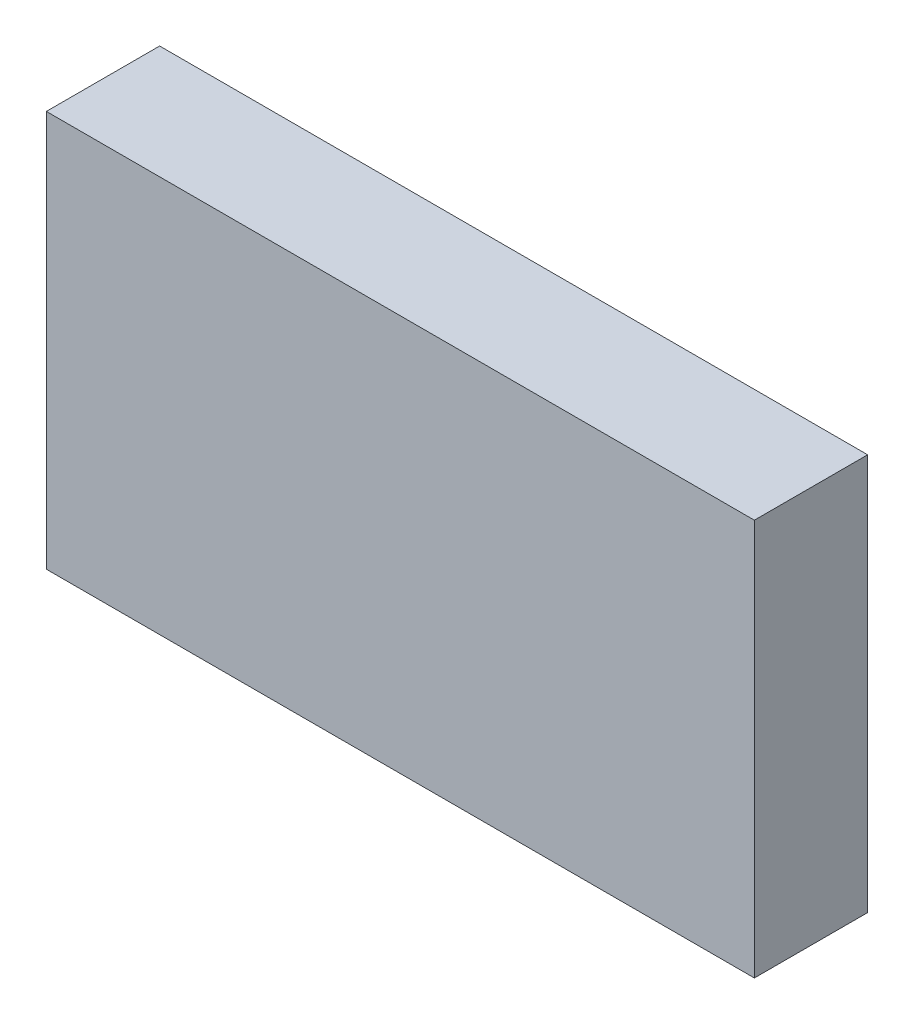
ISO-10303-21;
HEADER;
FILE_DESCRIPTION(('STEP AP214'),'2;1');
FILE_NAME('part.step','',(''),(''),'','','');
FILE_SCHEMA(('AUTOMOTIVE_DESIGN { 1 0 10303 214 1 1 1 1 }'));
ENDSEC;
DATA;
#1=APPLICATION_CONTEXT('core data for automotive mechanical design processes');
#2=APPLICATION_PROTOCOL_DEFINITION('international standard','automotive_design',2000,#1);
#3=PRODUCT_CONTEXT('',#1,'mechanical');
#4=PRODUCT('Part','Part','',(#3));
#5=PRODUCT_RELATED_PRODUCT_CATEGORY('part','',(#4));
#6=PRODUCT_DEFINITION_FORMATION('','',#4);
#7=PRODUCT_DEFINITION_CONTEXT('part definition',#1,'design');
#8=PRODUCT_DEFINITION('design','',#6,#7);
#9=PRODUCT_DEFINITION_SHAPE('','',#8);
#10=(LENGTH_UNIT() NAMED_UNIT(*) SI_UNIT(.MILLI.,.METRE.));
#11=(NAMED_UNIT(*) PLANE_ANGLE_UNIT() SI_UNIT($,.RADIAN.));
#12=(NAMED_UNIT(*) SI_UNIT($,.STERADIAN.) SOLID_ANGLE_UNIT());
#13=UNCERTAINTY_MEASURE_WITH_UNIT(LENGTH_MEASURE(1.E-05),#10,'distance_accuracy_value','');
#14=(GEOMETRIC_REPRESENTATION_CONTEXT(3) GLOBAL_UNCERTAINTY_ASSIGNED_CONTEXT((#13)) GLOBAL_UNIT_ASSIGNED_CONTEXT((#10,
#11,#12)) REPRESENTATION_CONTEXT('',''));
#15=CARTESIAN_POINT('',(0.,0.,0.));
#16=DIRECTION('',(0.,0.,1.));
#17=DIRECTION('',(1.,0.,0.));
#18=AXIS2_PLACEMENT_3D('',#15,#16,#17);
#19=CARTESIAN_POINT('',(79.375,-44.45,-6.35));
#20=DIRECTION('',(1.,0.,0.));
#21=DIRECTION('',(0.,0.,-1.));
#22=AXIS2_PLACEMENT_3D('',#19,#20,#21);
#23=PLANE('',#22);
#24=DIRECTION('',(0.,1.,0.));
#25=VECTOR('',#24,1.);
#26=CARTESIAN_POINT('',(79.375,-44.45,19.05));
#27=LINE('',#26,#25);
#28=CARTESIAN_POINT('',(79.375,-44.45,19.05));
#29=VERTEX_POINT('',#28);
#30=CARTESIAN_POINT('',(79.375,44.45,19.05));
#31=VERTEX_POINT('',#30);
#32=EDGE_CURVE('E113',#29,#31,#27,.T.);
#33=ORIENTED_EDGE('',*,*,#32,.F.);
#34=DIRECTION('',(0.,0.,1.));
#35=VECTOR('',#34,1.);
#36=CARTESIAN_POINT('',(79.375,-44.45,-6.35));
#37=LINE('',#36,#35);
#38=CARTESIAN_POINT('',(79.375,-44.45,-6.35));
#39=VERTEX_POINT('',#38);
#40=EDGE_CURVE('E12',#39,#29,#37,.T.);
#41=ORIENTED_EDGE('',*,*,#40,.F.);
#42=DIRECTION('',(0.,1.,0.));
#43=VECTOR('',#42,1.);
#44=CARTESIAN_POINT('',(79.375,-44.45,-6.35));
#45=LINE('',#44,#43);
#46=CARTESIAN_POINT('',(79.375,44.45,-6.35));
#47=VERTEX_POINT('',#46);
#48=EDGE_CURVE('E107',#39,#47,#45,.T.);
#49=ORIENTED_EDGE('',*,*,#48,.T.);
#50=DIRECTION('',(0.,0.,1.));
#51=VECTOR('',#50,1.);
#52=CARTESIAN_POINT('',(79.375,44.45,-6.35));
#53=LINE('',#52,#51);
#54=EDGE_CURVE('E52',#47,#31,#53,.T.);
#55=ORIENTED_EDGE('',*,*,#54,.T.);
#56=EDGE_LOOP('',(#33,#41,#49,#55));
#57=FACE_BOUND('',#56,.T.);
#58=ADVANCED_FACE('F49',(#57),#23,.T.);
#59=CARTESIAN_POINT('',(-79.375,-44.45,-6.35));
#60=DIRECTION('',(0.,-1.,0.));
#61=DIRECTION('',(0.,0.,-1.));
#62=AXIS2_PLACEMENT_3D('',#59,#60,#61);
#63=PLANE('',#62);
#64=DIRECTION('',(1.,0.,0.));
#65=VECTOR('',#64,1.);
#66=CARTESIAN_POINT('',(-79.375,-44.45,19.05));
#67=LINE('',#66,#65);
#68=CARTESIAN_POINT('',(-79.375,-44.45,19.05));
#69=VERTEX_POINT('',#68);
#70=EDGE_CURVE('E109',#69,#29,#67,.T.);
#71=ORIENTED_EDGE('',*,*,#70,.F.);
#72=DIRECTION('',(0.,0.,1.));
#73=VECTOR('',#72,1.);
#74=CARTESIAN_POINT('',(-79.375,-44.45,-6.35));
#75=LINE('',#74,#73);
#76=CARTESIAN_POINT('',(-79.375,-44.45,-6.35));
#77=VERTEX_POINT('',#76);
#78=EDGE_CURVE('E58',#77,#69,#75,.T.);
#79=ORIENTED_EDGE('',*,*,#78,.F.);
#80=DIRECTION('',(1.,0.,0.));
#81=VECTOR('',#80,1.);
#82=CARTESIAN_POINT('',(-79.375,-44.45,-6.35));
#83=LINE('',#82,#81);
#84=EDGE_CURVE('E104',#77,#39,#83,.T.);
#85=ORIENTED_EDGE('',*,*,#84,.T.);
#86=ORIENTED_EDGE('',*,*,#40,.T.);
#87=EDGE_LOOP('',(#71,#79,#85,#86));
#88=FACE_BOUND('',#87,.T.);
#89=ADVANCED_FACE('F123',(#88),#63,.T.);
#90=CARTESIAN_POINT('',(-79.375,-44.45,-6.35));
#91=DIRECTION('',(-1.,0.,0.));
#92=DIRECTION('',(0.,0.,1.));
#93=AXIS2_PLACEMENT_3D('',#90,#91,#92);
#94=PLANE('',#93);
#95=DIRECTION('',(0.,-1.,0.));
#96=VECTOR('',#95,1.);
#97=CARTESIAN_POINT('',(-79.375,-44.45,19.05));
#98=LINE('',#97,#96);
#99=CARTESIAN_POINT('',(-79.375,44.45,19.05));
#100=VERTEX_POINT('',#99);
#101=EDGE_CURVE('E99',#100,#69,#98,.T.);
#102=ORIENTED_EDGE('',*,*,#101,.F.);
#103=DIRECTION('',(0.,0.,1.));
#104=VECTOR('',#103,1.);
#105=CARTESIAN_POINT('',(-79.375,44.45,-6.35));
#106=LINE('',#105,#104);
#107=CARTESIAN_POINT('',(-79.375,44.45,-6.35));
#108=VERTEX_POINT('',#107);
#109=EDGE_CURVE('E94',#108,#100,#106,.T.);
#110=ORIENTED_EDGE('',*,*,#109,.F.);
#111=DIRECTION('',(0.,-1.,0.));
#112=VECTOR('',#111,1.);
#113=CARTESIAN_POINT('',(-79.375,-44.45,-6.35));
#114=LINE('',#113,#112);
#115=EDGE_CURVE('E97',#108,#77,#114,.T.);
#116=ORIENTED_EDGE('',*,*,#115,.T.);
#117=ORIENTED_EDGE('',*,*,#78,.T.);
#118=EDGE_LOOP('',(#102,#110,#116,#117));
#119=FACE_BOUND('',#118,.T.);
#120=ADVANCED_FACE('F96',(#119),#94,.T.);
#121=CARTESIAN_POINT('',(-79.375,44.45,-6.35));
#122=DIRECTION('',(0.,1.,0.));
#123=DIRECTION('',(0.,0.,1.));
#124=AXIS2_PLACEMENT_3D('',#121,#122,#123);
#125=PLANE('',#124);
#126=DIRECTION('',(-1.,0.,0.));
#127=VECTOR('',#126,1.);
#128=CARTESIAN_POINT('',(-79.375,44.45,19.05));
#129=LINE('',#128,#127);
#130=EDGE_CURVE('E116',#31,#100,#129,.T.);
#131=ORIENTED_EDGE('',*,*,#130,.F.);
#132=ORIENTED_EDGE('',*,*,#54,.F.);
#133=DIRECTION('',(-1.,0.,0.));
#134=VECTOR('',#133,1.);
#135=CARTESIAN_POINT('',(-79.375,44.45,-6.35));
#136=LINE('',#135,#134);
#137=EDGE_CURVE('E103',#47,#108,#136,.T.);
#138=ORIENTED_EDGE('',*,*,#137,.T.);
#139=ORIENTED_EDGE('',*,*,#109,.T.);
#140=EDGE_LOOP('',(#131,#132,#138,#139));
#141=FACE_BOUND('',#140,.T.);
#142=ADVANCED_FACE('F106',(#141),#125,.T.);
#143=CARTESIAN_POINT('',(79.3749999999999,44.45,-6.35));
#144=DIRECTION('',(0.,0.,-1.));
#145=DIRECTION('',(-1.,0.,0.));
#146=AXIS2_PLACEMENT_3D('',#143,#144,#145);
#147=PLANE('',#146);
#148=ORIENTED_EDGE('',*,*,#48,.F.);
#149=ORIENTED_EDGE('',*,*,#84,.F.);
#150=ORIENTED_EDGE('',*,*,#115,.F.);
#151=ORIENTED_EDGE('',*,*,#137,.F.);
#152=EDGE_LOOP('',(#148,#149,#150,#151));
#153=FACE_BOUND('',#152,.T.);
#154=ADVANCED_FACE('F102',(#153),#147,.T.);
#155=CARTESIAN_POINT('',(79.3749999999999,44.45,19.05));
#156=DIRECTION('',(0.,0.,-1.));
#157=DIRECTION('',(-1.,0.,0.));
#158=AXIS2_PLACEMENT_3D('',#155,#156,#157);
#159=PLANE('',#158);
#160=ORIENTED_EDGE('',*,*,#32,.T.);
#161=ORIENTED_EDGE('',*,*,#130,.T.);
#162=ORIENTED_EDGE('',*,*,#101,.T.);
#163=ORIENTED_EDGE('',*,*,#70,.T.);
#164=EDGE_LOOP('',(#160,#161,#162,#163));
#165=FACE_BOUND('',#164,.T.);
#166=ADVANCED_FACE('F122',(#165),#159,.F.);
#167=CLOSED_SHELL('',(#58,#89,#120,#142,#154,#166));
#168=MANIFOLD_SOLID_BREP('B2',#167);
#169=CARTESIAN_POINT('',(76.2,-41.275,19.05));
#170=DIRECTION('',(-1.,0.,0.));
#171=DIRECTION('',(0.,0.,1.));
#172=AXIS2_PLACEMENT_3D('',#169,#170,#171);
#173=PLANE('',#172);
#174=DIRECTION('',(0.,1.,0.));
#175=VECTOR('',#174,1.);
#176=CARTESIAN_POINT('',(76.2,-41.275,0.));
#177=LINE('',#176,#175);
#178=CARTESIAN_POINT('',(76.2,-38.735,0.));
#179=VERTEX_POINT('',#178);
#180=CARTESIAN_POINT('',(76.2,38.735,0.));
#181=VERTEX_POINT('',#180);
#182=EDGE_CURVE('E367',#179,#181,#177,.T.);
#183=ORIENTED_EDGE('',*,*,#182,.T.);
#184=DIRECTION('',(0.,0.,-1.));
#185=VECTOR('',#184,1.);
#186=CARTESIAN_POINT('',(76.2,38.735,19.05));
#187=LINE('',#186,#185);
#188=CARTESIAN_POINT('',(76.2,38.735,19.05));
#189=VERTEX_POINT('',#188);
#190=EDGE_CURVE('E416',#181,#189,#187,.F.);
#191=ORIENTED_EDGE('',*,*,#190,.T.);
#192=DIRECTION('',(0.,1.,0.));
#193=VECTOR('',#192,1.);
#194=CARTESIAN_POINT('',(76.2,-41.275,19.05));
#195=LINE('',#194,#193);
#196=CARTESIAN_POINT('',(76.2,-38.735,19.05));
#197=VERTEX_POINT('',#196);
#198=EDGE_CURVE('E377',#197,#189,#195,.T.);
#199=ORIENTED_EDGE('',*,*,#198,.F.);
#200=DIRECTION('',(0.,0.,-1.));
#201=VECTOR('',#200,1.);
#202=CARTESIAN_POINT('',(76.2,-38.735,19.05));
#203=LINE('',#202,#201);
#204=EDGE_CURVE('E413',#197,#179,#203,.T.);
#205=ORIENTED_EDGE('',*,*,#204,.T.);
#206=EDGE_LOOP('',(#183,#191,#199,#205));
#207=FACE_BOUND('',#206,.T.);
#208=ADVANCED_FACE('F173',(#207),#173,.F.);
#209=CARTESIAN_POINT('',(-76.2,41.275,19.05));
#210=DIRECTION('',(0.,-1.,0.));
#211=DIRECTION('',(0.,0.,-1.));
#212=AXIS2_PLACEMENT_3D('',#209,#210,#211);
#213=PLANE('',#212);
#214=DIRECTION('',(-1.,0.,0.));
#215=VECTOR('',#214,1.);
#216=CARTESIAN_POINT('',(-76.2,41.275,19.05));
#217=LINE('',#216,#215);
#218=CARTESIAN_POINT('',(73.66,41.275,19.05));
#219=VERTEX_POINT('',#218);
#220=CARTESIAN_POINT('',(-73.66,41.275,19.05));
#221=VERTEX_POINT('',#220);
#222=EDGE_CURVE('E380',#219,#221,#217,.T.);
#223=ORIENTED_EDGE('',*,*,#222,.F.);
#224=DIRECTION('',(0.,0.,-1.));
#225=VECTOR('',#224,1.);
#226=CARTESIAN_POINT('',(73.66,41.275,19.05));
#227=LINE('',#226,#225);
#228=CARTESIAN_POINT('',(73.66,41.275,0.));
#229=VERTEX_POINT('',#228);
#230=EDGE_CURVE('E402',#219,#229,#227,.T.);
#231=ORIENTED_EDGE('',*,*,#230,.T.);
#232=DIRECTION('',(-1.,0.,0.));
#233=VECTOR('',#232,1.);
#234=CARTESIAN_POINT('',(-76.2,41.275,0.));
#235=LINE('',#234,#233);
#236=CARTESIAN_POINT('',(-73.66,41.275,0.));
#237=VERTEX_POINT('',#236);
#238=EDGE_CURVE('E393',#229,#237,#235,.T.);
#239=ORIENTED_EDGE('',*,*,#238,.T.);
#240=DIRECTION('',(0.,0.,-1.));
#241=VECTOR('',#240,1.);
#242=CARTESIAN_POINT('',(-73.66,41.275,19.05));
#243=LINE('',#242,#241);
#244=EDGE_CURVE('E390',#237,#221,#243,.F.);
#245=ORIENTED_EDGE('',*,*,#244,.T.);
#246=EDGE_LOOP('',(#223,#231,#239,#245));
#247=FACE_BOUND('',#246,.T.);
#248=ADVANCED_FACE('F548',(#247),#213,.F.);
#249=CARTESIAN_POINT('',(-76.2,-41.275,19.05));
#250=DIRECTION('',(1.,0.,0.));
#251=DIRECTION('',(0.,0.,-1.));
#252=AXIS2_PLACEMENT_3D('',#249,#250,#251);
#253=PLANE('',#252);
#254=DIRECTION('',(0.,-1.,0.));
#255=VECTOR('',#254,1.);
#256=CARTESIAN_POINT('',(-76.2,-41.275,0.));
#257=LINE('',#256,#255);
#258=CARTESIAN_POINT('',(-76.2,38.735,0.));
#259=VERTEX_POINT('',#258);
#260=CARTESIAN_POINT('',(-76.2,-38.735,0.));
#261=VERTEX_POINT('',#260);
#262=EDGE_CURVE('E396',#259,#261,#257,.T.);
#263=ORIENTED_EDGE('',*,*,#262,.T.);
#264=DIRECTION('',(0.,0.,-1.));
#265=VECTOR('',#264,1.);
#266=CARTESIAN_POINT('',(-76.2,-38.735,19.05));
#267=LINE('',#266,#265);
#268=CARTESIAN_POINT('',(-76.2,-38.735,19.05));
#269=VERTEX_POINT('',#268);
#270=EDGE_CURVE('E434',#261,#269,#267,.F.);
#271=ORIENTED_EDGE('',*,*,#270,.T.);
#272=DIRECTION('',(0.,-1.,0.));
#273=VECTOR('',#272,1.);
#274=CARTESIAN_POINT('',(-76.2,-41.275,19.05));
#275=LINE('',#274,#273);
#276=CARTESIAN_POINT('',(-76.2,38.735,19.05));
#277=VERTEX_POINT('',#276);
#278=EDGE_CURVE('E384',#277,#269,#275,.T.);
#279=ORIENTED_EDGE('',*,*,#278,.F.);
#280=DIRECTION('',(0.,0.,-1.));
#281=VECTOR('',#280,1.);
#282=CARTESIAN_POINT('',(-76.2,38.735,19.05));
#283=LINE('',#282,#281);
#284=EDGE_CURVE('E431',#277,#259,#283,.T.);
#285=ORIENTED_EDGE('',*,*,#284,.T.);
#286=EDGE_LOOP('',(#263,#271,#279,#285));
#287=FACE_BOUND('',#286,.T.);
#288=ADVANCED_FACE('F554',(#287),#253,.F.);
#289=CARTESIAN_POINT('',(-76.2,-41.275,19.05));
#290=DIRECTION('',(0.,1.,0.));
#291=DIRECTION('',(0.,0.,1.));
#292=AXIS2_PLACEMENT_3D('',#289,#290,#291);
#293=PLANE('',#292);
#294=DIRECTION('',(1.,0.,0.));
#295=VECTOR('',#294,1.);
#296=CARTESIAN_POINT('',(-76.2,-41.275,0.));
#297=LINE('',#296,#295);
#298=CARTESIAN_POINT('',(-73.66,-41.275,0.));
#299=VERTEX_POINT('',#298);
#300=CARTESIAN_POINT('',(73.66,-41.275,0.));
#301=VERTEX_POINT('',#300);
#302=EDGE_CURVE('E381',#299,#301,#297,.T.);
#303=ORIENTED_EDGE('',*,*,#302,.T.);
#304=DIRECTION('',(0.,0.,-1.));
#305=VECTOR('',#304,1.);
#306=CARTESIAN_POINT('',(73.66,-41.275,19.05));
#307=LINE('',#306,#305);
#308=CARTESIAN_POINT('',(73.66,-41.275,19.05));
#309=VERTEX_POINT('',#308);
#310=EDGE_CURVE('E429',#301,#309,#307,.F.);
#311=ORIENTED_EDGE('',*,*,#310,.T.);
#312=DIRECTION('',(1.,0.,0.));
#313=VECTOR('',#312,1.);
#314=CARTESIAN_POINT('',(-76.2,-41.275,19.05));
#315=LINE('',#314,#313);
#316=CARTESIAN_POINT('',(-73.66,-41.275,19.05));
#317=VERTEX_POINT('',#316);
#318=EDGE_CURVE('E387',#317,#309,#315,.T.);
#319=ORIENTED_EDGE('',*,*,#318,.F.);
#320=DIRECTION('',(0.,0.,-1.));
#321=VECTOR('',#320,1.);
#322=CARTESIAN_POINT('',(-73.66,-41.275,19.05));
#323=LINE('',#322,#321);
#324=EDGE_CURVE('E426',#317,#299,#323,.T.);
#325=ORIENTED_EDGE('',*,*,#324,.T.);
#326=EDGE_LOOP('',(#303,#311,#319,#325));
#327=FACE_BOUND('',#326,.T.);
#328=ADVANCED_FACE('F606',(#327),#293,.F.);
#329=CARTESIAN_POINT('',(76.2,41.275,19.05));
#330=DIRECTION('',(0.,0.,-1.));
#331=DIRECTION('',(-1.,0.,0.));
#332=AXIS2_PLACEMENT_3D('',#329,#330,#331);
#333=PLANE('',#332);
#334=DIRECTION('',(0.,-1.,0.));
#335=VECTOR('',#334,1.);
#336=CARTESIAN_POINT('',(-60.325,36.195,19.05));
#337=LINE('',#336,#335);
#338=CARTESIAN_POINT('',(-60.325,-22.225,19.05));
#339=VERTEX_POINT('',#338);
#340=CARTESIAN_POINT('',(-60.325,-31.115,19.05));
#341=VERTEX_POINT('',#340);
#342=EDGE_CURVE('E373',#339,#341,#337,.T.);
#343=ORIENTED_EDGE('',*,*,#342,.F.);
#344=DIRECTION('',(1.,0.,0.));
#345=VECTOR('',#344,1.);
#346=CARTESIAN_POINT('',(-60.325,-22.225,19.05));
#347=LINE('',#346,#345);
#348=CARTESIAN_POINT('',(-66.04,-22.225,19.05));
#349=VERTEX_POINT('',#348);
#350=EDGE_CURVE('E340',#349,#339,#347,.T.);
#351=ORIENTED_EDGE('',*,*,#350,.F.);
#352=CARTESIAN_POINT('',(-66.04,-17.145,19.05));
#353=DIRECTION('',(0.,0.,-1.));
#354=DIRECTION('',(-1.,0.,0.));
#355=AXIS2_PLACEMENT_3D('',#352,#353,#354);
#356=CIRCLE('',#355,5.08);
#357=CARTESIAN_POINT('',(-71.12,-17.145,19.05));
#358=VERTEX_POINT('',#357);
#359=EDGE_CURVE('E47',#349,#358,#356,.T.);
#360=ORIENTED_EDGE('',*,*,#359,.T.);
#361=DIRECTION('',(0.,-1.,0.));
#362=VECTOR('',#361,1.);
#363=CARTESIAN_POINT('',(-71.12,22.225,19.05));
#364=LINE('',#363,#362);
#365=CARTESIAN_POINT('',(-71.12,17.145,19.05));
#366=VERTEX_POINT('',#365);
#367=EDGE_CURVE('E489',#366,#358,#364,.T.);
#368=ORIENTED_EDGE('',*,*,#367,.F.);
#369=CARTESIAN_POINT('',(-66.04,17.145,19.05));
#370=DIRECTION('',(0.,0.,-1.));
#371=DIRECTION('',(-1.,0.,0.));
#372=AXIS2_PLACEMENT_3D('',#369,#370,#371);
#373=CIRCLE('',#372,5.08);
#374=CARTESIAN_POINT('',(-66.04,22.225,19.05));
#375=VERTEX_POINT('',#374);
#376=EDGE_CURVE('E181',#366,#375,#373,.T.);
#377=ORIENTED_EDGE('',*,*,#376,.T.);
#378=DIRECTION('',(-1.,0.,0.));
#379=VECTOR('',#378,1.);
#380=CARTESIAN_POINT('',(-60.325,22.225,19.05));
#381=LINE('',#380,#379);
#382=CARTESIAN_POINT('',(-60.325,22.225,19.05));
#383=VERTEX_POINT('',#382);
#384=EDGE_CURVE('E487',#383,#375,#381,.T.);
#385=ORIENTED_EDGE('',*,*,#384,.F.);
#386=CARTESIAN_POINT('',(-60.325,31.115,19.05));
#387=VERTEX_POINT('',#386);
#388=EDGE_CURVE('E346',#387,#383,#337,.T.);
#389=ORIENTED_EDGE('',*,*,#388,.F.);
#390=CARTESIAN_POINT('',(-55.245,31.115,19.05));
#391=DIRECTION('',(0.,0.,-1.));
#392=DIRECTION('',(-1.,0.,0.));
#393=AXIS2_PLACEMENT_3D('',#390,#391,#392);
#394=CIRCLE('',#393,5.08);
#395=CARTESIAN_POINT('',(-55.245,36.195,19.05));
#396=VERTEX_POINT('',#395);
#397=EDGE_CURVE('E470',#387,#396,#394,.T.);
#398=ORIENTED_EDGE('',*,*,#397,.T.);
#399=DIRECTION('',(-1.,0.,0.));
#400=VECTOR('',#399,1.);
#401=CARTESIAN_POINT('',(71.12,36.195,19.05));
#402=LINE('',#401,#400);
#403=CARTESIAN_POINT('',(66.04,36.195,19.05));
#404=VERTEX_POINT('',#403);
#405=EDGE_CURVE('E370',#404,#396,#402,.T.);
#406=ORIENTED_EDGE('',*,*,#405,.F.);
#407=CARTESIAN_POINT('',(66.04,31.115,19.05));
#408=DIRECTION('',(0.,0.,-1.));
#409=DIRECTION('',(-1.,0.,0.));
#410=AXIS2_PLACEMENT_3D('',#407,#408,#409);
#411=CIRCLE('',#410,5.08);
#412=CARTESIAN_POINT('',(71.12,31.115,19.05));
#413=VERTEX_POINT('',#412);
#414=EDGE_CURVE('E463',#404,#413,#411,.T.);
#415=ORIENTED_EDGE('',*,*,#414,.T.);
#416=DIRECTION('',(0.,1.,0.));
#417=VECTOR('',#416,1.);
#418=CARTESIAN_POINT('',(71.12,36.195,19.05));
#419=LINE('',#418,#417);
#420=CARTESIAN_POINT('',(71.12,-31.115,19.05));
#421=VERTEX_POINT('',#420);
#422=EDGE_CURVE('E349',#421,#413,#419,.T.);
#423=ORIENTED_EDGE('',*,*,#422,.F.);
#424=CARTESIAN_POINT('',(66.04,-31.115,19.05));
#425=DIRECTION('',(0.,0.,-1.));
#426=DIRECTION('',(-1.,0.,0.));
#427=AXIS2_PLACEMENT_3D('',#424,#425,#426);
#428=CIRCLE('',#427,5.08);
#429=CARTESIAN_POINT('',(66.04,-36.195,19.05));
#430=VERTEX_POINT('',#429);
#431=EDGE_CURVE('E465',#421,#430,#428,.T.);
#432=ORIENTED_EDGE('',*,*,#431,.T.);
#433=DIRECTION('',(1.,0.,0.));
#434=VECTOR('',#433,1.);
#435=CARTESIAN_POINT('',(71.12,-36.195,19.05));
#436=LINE('',#435,#434);
#437=CARTESIAN_POINT('',(-55.245,-36.195,19.05));
#438=VERTEX_POINT('',#437);
#439=EDGE_CURVE('E358',#438,#430,#436,.T.);
#440=ORIENTED_EDGE('',*,*,#439,.F.);
#441=CARTESIAN_POINT('',(-55.245,-31.115,19.05));
#442=DIRECTION('',(0.,0.,-1.));
#443=DIRECTION('',(-1.,0.,0.));
#444=AXIS2_PLACEMENT_3D('',#441,#442,#443);
#445=CIRCLE('',#444,5.08);
#446=EDGE_CURVE('E467',#438,#341,#445,.T.);
#447=ORIENTED_EDGE('',*,*,#446,.T.);
#448=EDGE_LOOP('',(#343,#351,#360,#368,#377,#385,#389,#398,#406,#415,#423,#432,#440,#447));
#449=FACE_BOUND('',#448,.T.);
#450=ORIENTED_EDGE('',*,*,#198,.T.);
#451=CARTESIAN_POINT('',(73.66,38.735,19.05));
#452=DIRECTION('',(0.,0.,-1.));
#453=DIRECTION('',(-1.,0.,0.));
#454=AXIS2_PLACEMENT_3D('',#451,#452,#453);
#455=CIRCLE('',#454,2.54);
#456=EDGE_CURVE('E424',#189,#219,#455,.F.);
#457=ORIENTED_EDGE('',*,*,#456,.T.);
#458=ORIENTED_EDGE('',*,*,#222,.T.);
#459=CARTESIAN_POINT('',(-73.66,38.735,19.05));
#460=DIRECTION('',(0.,0.,-1.));
#461=DIRECTION('',(-1.,0.,0.));
#462=AXIS2_PLACEMENT_3D('',#459,#460,#461);
#463=CIRCLE('',#462,2.54);
#464=EDGE_CURVE('E418',#221,#277,#463,.F.);
#465=ORIENTED_EDGE('',*,*,#464,.T.);
#466=ORIENTED_EDGE('',*,*,#278,.T.);
#467=CARTESIAN_POINT('',(-73.66,-38.735,19.05));
#468=DIRECTION('',(0.,0.,-1.));
#469=DIRECTION('',(-1.,0.,0.));
#470=AXIS2_PLACEMENT_3D('',#467,#468,#469);
#471=CIRCLE('',#470,2.54);
#472=EDGE_CURVE('E420',#269,#317,#471,.F.);
#473=ORIENTED_EDGE('',*,*,#472,.T.);
#474=ORIENTED_EDGE('',*,*,#318,.T.);
#475=CARTESIAN_POINT('',(73.66,-38.735,19.05));
#476=DIRECTION('',(0.,0.,-1.));
#477=DIRECTION('',(-1.,0.,0.));
#478=AXIS2_PLACEMENT_3D('',#475,#476,#477);
#479=CIRCLE('',#478,2.54);
#480=EDGE_CURVE('E422',#309,#197,#479,.F.);
#481=ORIENTED_EDGE('',*,*,#480,.T.);
#482=EDGE_LOOP('',(#450,#457,#458,#465,#466,#473,#474,#481));
#483=FACE_BOUND('',#482,.T.);
#484=ADVANCED_FACE('F485',(#449,#483),#333,.F.);
#485=CARTESIAN_POINT('',(76.2,41.275,0.));
#486=DIRECTION('',(0.,0.,-1.));
#487=DIRECTION('',(-1.,0.,0.));
#488=AXIS2_PLACEMENT_3D('',#485,#486,#487);
#489=PLANE('',#488);
#490=ORIENTED_EDGE('',*,*,#238,.F.);
#491=CARTESIAN_POINT('',(73.66,38.735,0.));
#492=DIRECTION('',(0.,0.,-1.));
#493=DIRECTION('',(-1.,0.,0.));
#494=AXIS2_PLACEMENT_3D('',#491,#492,#493);
#495=CIRCLE('',#494,2.54);
#496=EDGE_CURVE('E411',#229,#181,#495,.T.);
#497=ORIENTED_EDGE('',*,*,#496,.T.);
#498=ORIENTED_EDGE('',*,*,#182,.F.);
#499=CARTESIAN_POINT('',(73.66,-38.735,0.));
#500=DIRECTION('',(0.,0.,-1.));
#501=DIRECTION('',(-1.,0.,0.));
#502=AXIS2_PLACEMENT_3D('',#499,#500,#501);
#503=CIRCLE('',#502,2.54);
#504=EDGE_CURVE('E409',#179,#301,#503,.T.);
#505=ORIENTED_EDGE('',*,*,#504,.T.);
#506=ORIENTED_EDGE('',*,*,#302,.F.);
#507=CARTESIAN_POINT('',(-73.66,-38.735,0.));
#508=DIRECTION('',(0.,0.,-1.));
#509=DIRECTION('',(-1.,0.,0.));
#510=AXIS2_PLACEMENT_3D('',#507,#508,#509);
#511=CIRCLE('',#510,2.54);
#512=EDGE_CURVE('E407',#299,#261,#511,.T.);
#513=ORIENTED_EDGE('',*,*,#512,.T.);
#514=ORIENTED_EDGE('',*,*,#262,.F.);
#515=CARTESIAN_POINT('',(-73.66,38.735,0.));
#516=DIRECTION('',(0.,0.,-1.));
#517=DIRECTION('',(-1.,0.,0.));
#518=AXIS2_PLACEMENT_3D('',#515,#516,#517);
#519=CIRCLE('',#518,2.54);
#520=EDGE_CURVE('E405',#259,#237,#519,.T.);
#521=ORIENTED_EDGE('',*,*,#520,.T.);
#522=EDGE_LOOP('',(#490,#497,#498,#505,#506,#513,#514,#521));
#523=FACE_BOUND('',#522,.T.);
#524=ADVANCED_FACE('F544',(#523),#489,.T.);
#525=CARTESIAN_POINT('',(71.12,36.195,6.35));
#526=DIRECTION('',(1.,0.,0.));
#527=DIRECTION('',(0.,1.,0.));
#528=AXIS2_PLACEMENT_3D('',#525,#526,#527);
#529=PLANE('',#528);
#530=ORIENTED_EDGE('',*,*,#422,.T.);
#531=DIRECTION('',(0.,0.,1.));
#532=VECTOR('',#531,1.);
#533=CARTESIAN_POINT('',(71.12,31.115,6.35));
#534=LINE('',#533,#532);
#535=CARTESIAN_POINT('',(71.12,31.115,6.35));
#536=VERTEX_POINT('',#535);
#537=EDGE_CURVE('E444',#413,#536,#534,.F.);
#538=ORIENTED_EDGE('',*,*,#537,.T.);
#539=DIRECTION('',(0.,1.,0.));
#540=VECTOR('',#539,1.);
#541=CARTESIAN_POINT('',(71.12,36.195,6.35));
#542=LINE('',#541,#540);
#543=CARTESIAN_POINT('',(71.12,-31.115,6.35));
#544=VERTEX_POINT('',#543);
#545=EDGE_CURVE('E354',#544,#536,#542,.T.);
#546=ORIENTED_EDGE('',*,*,#545,.F.);
#547=DIRECTION('',(0.,0.,1.));
#548=VECTOR('',#547,1.);
#549=CARTESIAN_POINT('',(71.12,-31.115,19.05));
#550=LINE('',#549,#548);
#551=EDGE_CURVE('E441',#544,#421,#550,.T.);
#552=ORIENTED_EDGE('',*,*,#551,.T.);
#553=EDGE_LOOP('',(#530,#538,#546,#552));
#554=FACE_BOUND('',#553,.T.);
#555=ADVANCED_FACE('F528',(#554),#529,.F.);
#556=CARTESIAN_POINT('',(71.12,-36.195,6.35));
#557=DIRECTION('',(0.,-1.,0.));
#558=DIRECTION('',(1.,0.,0.));
#559=AXIS2_PLACEMENT_3D('',#556,#557,#558);
#560=PLANE('',#559);
#561=ORIENTED_EDGE('',*,*,#439,.T.);
#562=DIRECTION('',(0.,0.,1.));
#563=VECTOR('',#562,1.);
#564=CARTESIAN_POINT('',(66.04,-36.195,6.35));
#565=LINE('',#564,#563);
#566=CARTESIAN_POINT('',(66.04,-36.195,6.35));
#567=VERTEX_POINT('',#566);
#568=EDGE_CURVE('E457',#430,#567,#565,.F.);
#569=ORIENTED_EDGE('',*,*,#568,.T.);
#570=DIRECTION('',(1.,0.,0.));
#571=VECTOR('',#570,1.);
#572=CARTESIAN_POINT('',(71.12,-36.195,6.35));
#573=LINE('',#572,#571);
#574=CARTESIAN_POINT('',(-55.245,-36.195,6.35));
#575=VERTEX_POINT('',#574);
#576=EDGE_CURVE('E364',#575,#567,#573,.T.);
#577=ORIENTED_EDGE('',*,*,#576,.F.);
#578=DIRECTION('',(0.,0.,1.));
#579=VECTOR('',#578,1.);
#580=CARTESIAN_POINT('',(-55.245,-36.195,19.05));
#581=LINE('',#580,#579);
#582=EDGE_CURVE('E454',#575,#438,#581,.T.);
#583=ORIENTED_EDGE('',*,*,#582,.T.);
#584=EDGE_LOOP('',(#561,#569,#577,#583));
#585=FACE_BOUND('',#584,.T.);
#586=ADVANCED_FACE('F536',(#585),#560,.F.);
#587=CARTESIAN_POINT('',(-60.325,36.195,6.35));
#588=DIRECTION('',(-1.,0.,0.));
#589=DIRECTION('',(0.,-1.,0.));
#590=AXIS2_PLACEMENT_3D('',#587,#588,#589);
#591=PLANE('',#590);
#592=DIRECTION('',(0.,1.,0.));
#593=VECTOR('',#592,1.);
#594=CARTESIAN_POINT('',(-60.325,22.225,12.7));
#595=LINE('',#594,#593);
#596=CARTESIAN_POINT('',(-60.325,-22.225,12.7));
#597=VERTEX_POINT('',#596);
#598=CARTESIAN_POINT('',(-60.325,22.225,12.7));
#599=VERTEX_POINT('',#598);
#600=EDGE_CURVE('E332',#597,#599,#595,.T.);
#601=ORIENTED_EDGE('',*,*,#600,.F.);
#602=DIRECTION('',(0.,0.,1.));
#603=VECTOR('',#602,1.);
#604=CARTESIAN_POINT('',(-60.325,-22.225,12.7));
#605=LINE('',#604,#603);
#606=EDGE_CURVE('E347',#597,#339,#605,.T.);
#607=ORIENTED_EDGE('',*,*,#606,.T.);
#608=ORIENTED_EDGE('',*,*,#342,.T.);
#609=DIRECTION('',(0.,0.,1.));
#610=VECTOR('',#609,1.);
#611=CARTESIAN_POINT('',(-60.325,-31.115,6.35));
#612=LINE('',#611,#610);
#613=CARTESIAN_POINT('',(-60.325,-31.115,6.35));
#614=VERTEX_POINT('',#613);
#615=EDGE_CURVE('E461',#341,#614,#612,.F.);
#616=ORIENTED_EDGE('',*,*,#615,.T.);
#617=DIRECTION('',(0.,-1.,0.));
#618=VECTOR('',#617,1.);
#619=CARTESIAN_POINT('',(-60.325,36.195,6.35));
#620=LINE('',#619,#618);
#621=CARTESIAN_POINT('',(-60.325,31.115,6.35));
#622=VERTEX_POINT('',#621);
#623=EDGE_CURVE('E361',#622,#614,#620,.T.);
#624=ORIENTED_EDGE('',*,*,#623,.F.);
#625=DIRECTION('',(0.,0.,1.));
#626=VECTOR('',#625,1.);
#627=CARTESIAN_POINT('',(-60.325,31.115,19.05));
#628=LINE('',#627,#626);
#629=EDGE_CURVE('E459',#622,#387,#628,.T.);
#630=ORIENTED_EDGE('',*,*,#629,.T.);
#631=ORIENTED_EDGE('',*,*,#388,.T.);
#632=DIRECTION('',(0.,0.,1.));
#633=VECTOR('',#632,1.);
#634=CARTESIAN_POINT('',(-60.325,22.225,12.7));
#635=LINE('',#634,#633);
#636=EDGE_CURVE('E326',#599,#383,#635,.T.);
#637=ORIENTED_EDGE('',*,*,#636,.F.);
#638=EDGE_LOOP('',(#601,#607,#608,#616,#624,#630,#631,#637));
#639=FACE_BOUND('',#638,.T.);
#640=ADVANCED_FACE('F343',(#639),#591,.F.);
#641=CARTESIAN_POINT('',(71.12,36.195,6.35));
#642=DIRECTION('',(0.,1.,0.));
#643=DIRECTION('',(-1.,0.,0.));
#644=AXIS2_PLACEMENT_3D('',#641,#642,#643);
#645=PLANE('',#644);
#646=DIRECTION('',(-1.,0.,0.));
#647=VECTOR('',#646,1.);
#648=CARTESIAN_POINT('',(71.12,36.195,6.35));
#649=LINE('',#648,#647);
#650=CARTESIAN_POINT('',(66.04,36.195,6.35));
#651=VERTEX_POINT('',#650);
#652=CARTESIAN_POINT('',(-55.245,36.195,6.35));
#653=VERTEX_POINT('',#652);
#654=EDGE_CURVE('E357',#651,#653,#649,.T.);
#655=ORIENTED_EDGE('',*,*,#654,.F.);
#656=DIRECTION('',(0.,0.,1.));
#657=VECTOR('',#656,1.);
#658=CARTESIAN_POINT('',(66.04,36.195,19.05));
#659=LINE('',#658,#657);
#660=EDGE_CURVE('E438',#651,#404,#659,.T.);
#661=ORIENTED_EDGE('',*,*,#660,.T.);
#662=ORIENTED_EDGE('',*,*,#405,.T.);
#663=DIRECTION('',(0.,0.,1.));
#664=VECTOR('',#663,1.);
#665=CARTESIAN_POINT('',(-55.245,36.195,6.35));
#666=LINE('',#665,#664);
#667=EDGE_CURVE('E436',#396,#653,#666,.F.);
#668=ORIENTED_EDGE('',*,*,#667,.T.);
#669=EDGE_LOOP('',(#655,#661,#662,#668));
#670=FACE_BOUND('',#669,.T.);
#671=ADVANCED_FACE('F520',(#670),#645,.F.);
#672=CARTESIAN_POINT('',(71.12,-36.195,6.35));
#673=DIRECTION('',(0.,0.,-1.));
#674=DIRECTION('',(-1.,0.,0.));
#675=AXIS2_PLACEMENT_3D('',#672,#673,#674);
#676=PLANE('',#675);
#677=ORIENTED_EDGE('',*,*,#545,.T.);
#678=CARTESIAN_POINT('',(66.04,31.115,6.35));
#679=DIRECTION('',(0.,0.,-1.));
#680=DIRECTION('',(-1.,0.,0.));
#681=AXIS2_PLACEMENT_3D('',#678,#679,#680);
#682=CIRCLE('',#681,5.08);
#683=EDGE_CURVE('E452',#536,#651,#682,.F.);
#684=ORIENTED_EDGE('',*,*,#683,.T.);
#685=ORIENTED_EDGE('',*,*,#654,.T.);
#686=CARTESIAN_POINT('',(-55.245,31.115,6.35));
#687=DIRECTION('',(0.,0.,-1.));
#688=DIRECTION('',(-1.,0.,0.));
#689=AXIS2_PLACEMENT_3D('',#686,#687,#688);
#690=CIRCLE('',#689,5.08);
#691=EDGE_CURVE('E446',#653,#622,#690,.F.);
#692=ORIENTED_EDGE('',*,*,#691,.T.);
#693=ORIENTED_EDGE('',*,*,#623,.T.);
#694=CARTESIAN_POINT('',(-55.245,-31.115,6.35));
#695=DIRECTION('',(0.,0.,-1.));
#696=DIRECTION('',(-1.,0.,0.));
#697=AXIS2_PLACEMENT_3D('',#694,#695,#696);
#698=CIRCLE('',#697,5.08);
#699=EDGE_CURVE('E448',#614,#575,#698,.F.);
#700=ORIENTED_EDGE('',*,*,#699,.T.);
#701=ORIENTED_EDGE('',*,*,#576,.T.);
#702=CARTESIAN_POINT('',(66.04,-31.115,6.35));
#703=DIRECTION('',(0.,0.,-1.));
#704=DIRECTION('',(-1.,0.,0.));
#705=AXIS2_PLACEMENT_3D('',#702,#703,#704);
#706=CIRCLE('',#705,5.08);
#707=EDGE_CURVE('E450',#567,#544,#706,.F.);
#708=ORIENTED_EDGE('',*,*,#707,.T.);
#709=EDGE_LOOP('',(#677,#684,#685,#692,#693,#700,#701,#708));
#710=FACE_BOUND('',#709,.T.);
#711=ADVANCED_FACE('F511',(#710),#676,.F.);
#712=CARTESIAN_POINT('',(73.66,38.735,19.05));
#713=DIRECTION('',(0.,0.,-1.));
#714=DIRECTION('',(-1.,0.,0.));
#715=AXIS2_PLACEMENT_3D('',#712,#713,#714);
#716=CYLINDRICAL_SURFACE('',#715,2.54);
#717=ORIENTED_EDGE('',*,*,#456,.F.);
#718=ORIENTED_EDGE('',*,*,#190,.F.);
#719=ORIENTED_EDGE('',*,*,#496,.F.);
#720=ORIENTED_EDGE('',*,*,#230,.F.);
#721=EDGE_LOOP('',(#717,#718,#719,#720));
#722=FACE_BOUND('',#721,.T.);
#723=ADVANCED_FACE('F559',(#722),#716,.T.);
#724=CARTESIAN_POINT('',(73.66,-38.735,19.05));
#725=DIRECTION('',(0.,0.,-1.));
#726=DIRECTION('',(-1.,0.,0.));
#727=AXIS2_PLACEMENT_3D('',#724,#725,#726);
#728=CYLINDRICAL_SURFACE('',#727,2.54);
#729=ORIENTED_EDGE('',*,*,#480,.F.);
#730=ORIENTED_EDGE('',*,*,#310,.F.);
#731=ORIENTED_EDGE('',*,*,#504,.F.);
#732=ORIENTED_EDGE('',*,*,#204,.F.);
#733=EDGE_LOOP('',(#729,#730,#731,#732));
#734=FACE_BOUND('',#733,.T.);
#735=ADVANCED_FACE('F562',(#734),#728,.T.);
#736=CARTESIAN_POINT('',(-73.66,-38.735,19.05));
#737=DIRECTION('',(0.,0.,-1.));
#738=DIRECTION('',(-1.,0.,0.));
#739=AXIS2_PLACEMENT_3D('',#736,#737,#738);
#740=CYLINDRICAL_SURFACE('',#739,2.54);
#741=ORIENTED_EDGE('',*,*,#472,.F.);
#742=ORIENTED_EDGE('',*,*,#270,.F.);
#743=ORIENTED_EDGE('',*,*,#512,.F.);
#744=ORIENTED_EDGE('',*,*,#324,.F.);
#745=EDGE_LOOP('',(#741,#742,#743,#744));
#746=FACE_BOUND('',#745,.T.);
#747=ADVANCED_FACE('F566',(#746),#740,.T.);
#748=CARTESIAN_POINT('',(-73.66,38.735,19.05));
#749=DIRECTION('',(0.,0.,-1.));
#750=DIRECTION('',(-1.,0.,0.));
#751=AXIS2_PLACEMENT_3D('',#748,#749,#750);
#752=CYLINDRICAL_SURFACE('',#751,2.54);
#753=ORIENTED_EDGE('',*,*,#464,.F.);
#754=ORIENTED_EDGE('',*,*,#244,.F.);
#755=ORIENTED_EDGE('',*,*,#520,.F.);
#756=ORIENTED_EDGE('',*,*,#284,.F.);
#757=EDGE_LOOP('',(#753,#754,#755,#756));
#758=FACE_BOUND('',#757,.T.);
#759=ADVANCED_FACE('F570',(#758),#752,.T.);
#760=CARTESIAN_POINT('',(66.04,31.115,6.35));
#761=DIRECTION('',(0.,0.,-1.));
#762=DIRECTION('',(-1.,0.,0.));
#763=AXIS2_PLACEMENT_3D('',#760,#761,#762);
#764=CYLINDRICAL_SURFACE('',#763,5.08);
#765=ORIENTED_EDGE('',*,*,#683,.F.);
#766=ORIENTED_EDGE('',*,*,#537,.F.);
#767=ORIENTED_EDGE('',*,*,#414,.F.);
#768=ORIENTED_EDGE('',*,*,#660,.F.);
#769=EDGE_LOOP('',(#765,#766,#767,#768));
#770=FACE_BOUND('',#769,.T.);
#771=ADVANCED_FACE('F524',(#770),#764,.F.);
#772=CARTESIAN_POINT('',(66.04,-31.115,6.35));
#773=DIRECTION('',(0.,0.,-1.));
#774=DIRECTION('',(-1.,0.,0.));
#775=AXIS2_PLACEMENT_3D('',#772,#773,#774);
#776=CYLINDRICAL_SURFACE('',#775,5.08);
#777=ORIENTED_EDGE('',*,*,#707,.F.);
#778=ORIENTED_EDGE('',*,*,#568,.F.);
#779=ORIENTED_EDGE('',*,*,#431,.F.);
#780=ORIENTED_EDGE('',*,*,#551,.F.);
#781=EDGE_LOOP('',(#777,#778,#779,#780));
#782=FACE_BOUND('',#781,.T.);
#783=ADVANCED_FACE('F533',(#782),#776,.F.);
#784=CARTESIAN_POINT('',(-55.245,-31.115,6.35));
#785=DIRECTION('',(0.,0.,-1.));
#786=DIRECTION('',(-1.,0.,0.));
#787=AXIS2_PLACEMENT_3D('',#784,#785,#786);
#788=CYLINDRICAL_SURFACE('',#787,5.08);
#789=ORIENTED_EDGE('',*,*,#699,.F.);
#790=ORIENTED_EDGE('',*,*,#615,.F.);
#791=ORIENTED_EDGE('',*,*,#446,.F.);
#792=ORIENTED_EDGE('',*,*,#582,.F.);
#793=EDGE_LOOP('',(#789,#790,#791,#792));
#794=FACE_BOUND('',#793,.T.);
#795=ADVANCED_FACE('F507',(#794),#788,.F.);
#796=CARTESIAN_POINT('',(-55.245,31.115,6.35));
#797=DIRECTION('',(0.,0.,-1.));
#798=DIRECTION('',(-1.,0.,0.));
#799=AXIS2_PLACEMENT_3D('',#796,#797,#798);
#800=CYLINDRICAL_SURFACE('',#799,5.08);
#801=ORIENTED_EDGE('',*,*,#691,.F.);
#802=ORIENTED_EDGE('',*,*,#667,.F.);
#803=ORIENTED_EDGE('',*,*,#397,.F.);
#804=ORIENTED_EDGE('',*,*,#629,.F.);
#805=EDGE_LOOP('',(#801,#802,#803,#804));
#806=FACE_BOUND('',#805,.T.);
#807=ADVANCED_FACE('F517',(#806),#800,.F.);
#808=CARTESIAN_POINT('',(-60.325,-22.225,12.7));
#809=DIRECTION('',(0.,-1.,0.));
#810=DIRECTION('',(1.,0.,0.));
#811=AXIS2_PLACEMENT_3D('',#808,#809,#810);
#812=PLANE('',#811);
#813=DIRECTION('',(1.,0.,0.));
#814=VECTOR('',#813,1.);
#815=CARTESIAN_POINT('',(-60.325,-22.225,12.7));
#816=LINE('',#815,#814);
#817=CARTESIAN_POINT('',(-66.04,-22.225,12.7));
#818=VERTEX_POINT('',#817);
#819=EDGE_CURVE('E336',#818,#597,#816,.T.);
#820=ORIENTED_EDGE('',*,*,#819,.F.);
#821=DIRECTION('',(0.,0.,1.));
#822=VECTOR('',#821,1.);
#823=CARTESIAN_POINT('',(-66.04,-22.225,19.05));
#824=LINE('',#823,#822);
#825=EDGE_CURVE('E481',#818,#349,#824,.T.);
#826=ORIENTED_EDGE('',*,*,#825,.T.);
#827=ORIENTED_EDGE('',*,*,#350,.T.);
#828=ORIENTED_EDGE('',*,*,#606,.F.);
#829=EDGE_LOOP('',(#820,#826,#827,#828));
#830=FACE_BOUND('',#829,.T.);
#831=ADVANCED_FACE('F501',(#830),#812,.F.);
#832=CARTESIAN_POINT('',(-71.12,22.225,12.7));
#833=DIRECTION('',(-1.,0.,0.));
#834=DIRECTION('',(0.,0.,1.));
#835=AXIS2_PLACEMENT_3D('',#832,#833,#834);
#836=PLANE('',#835);
#837=DIRECTION('',(0.,-1.,0.));
#838=VECTOR('',#837,1.);
#839=CARTESIAN_POINT('',(-71.12,22.225,12.7));
#840=LINE('',#839,#838);
#841=CARTESIAN_POINT('',(-71.12,17.145,12.7));
#842=VERTEX_POINT('',#841);
#843=CARTESIAN_POINT('',(-71.12,-17.145,12.7));
#844=VERTEX_POINT('',#843);
#845=EDGE_CURVE('E331',#842,#844,#840,.T.);
#846=ORIENTED_EDGE('',*,*,#845,.F.);
#847=DIRECTION('',(0.,0.,1.));
#848=VECTOR('',#847,1.);
#849=CARTESIAN_POINT('',(-71.12,17.145,19.05));
#850=LINE('',#849,#848);
#851=EDGE_CURVE('E474',#842,#366,#850,.T.);
#852=ORIENTED_EDGE('',*,*,#851,.T.);
#853=ORIENTED_EDGE('',*,*,#367,.T.);
#854=DIRECTION('',(0.,0.,1.));
#855=VECTOR('',#854,1.);
#856=CARTESIAN_POINT('',(-71.12,-17.145,12.7));
#857=LINE('',#856,#855);
#858=EDGE_CURVE('E472',#358,#844,#857,.F.);
#859=ORIENTED_EDGE('',*,*,#858,.T.);
#860=EDGE_LOOP('',(#846,#852,#853,#859));
#861=FACE_BOUND('',#860,.T.);
#862=ADVANCED_FACE('F496',(#861),#836,.F.);
#863=CARTESIAN_POINT('',(-60.325,22.225,12.7));
#864=DIRECTION('',(0.,1.,0.));
#865=DIRECTION('',(-1.,0.,0.));
#866=AXIS2_PLACEMENT_3D('',#863,#864,#865);
#867=PLANE('',#866);
#868=ORIENTED_EDGE('',*,*,#384,.T.);
#869=DIRECTION('',(0.,0.,1.));
#870=VECTOR('',#869,1.);
#871=CARTESIAN_POINT('',(-66.04,22.225,12.7));
#872=LINE('',#871,#870);
#873=CARTESIAN_POINT('',(-66.04,22.225,12.7));
#874=VERTEX_POINT('',#873);
#875=EDGE_CURVE('E329',#375,#874,#872,.F.);
#876=ORIENTED_EDGE('',*,*,#875,.T.);
#877=DIRECTION('',(-1.,0.,0.));
#878=VECTOR('',#877,1.);
#879=CARTESIAN_POINT('',(-60.325,22.225,12.7));
#880=LINE('',#879,#878);
#881=EDGE_CURVE('E321',#599,#874,#880,.T.);
#882=ORIENTED_EDGE('',*,*,#881,.F.);
#883=ORIENTED_EDGE('',*,*,#636,.T.);
#884=EDGE_LOOP('',(#868,#876,#882,#883));
#885=FACE_BOUND('',#884,.T.);
#886=ADVANCED_FACE('F324',(#885),#867,.F.);
#887=CARTESIAN_POINT('',(-60.325,-22.225,12.7));
#888=DIRECTION('',(0.,0.,-1.));
#889=DIRECTION('',(-1.,0.,0.));
#890=AXIS2_PLACEMENT_3D('',#887,#888,#889);
#891=PLANE('',#890);
#892=ORIENTED_EDGE('',*,*,#881,.T.);
#893=CARTESIAN_POINT('',(-66.04,17.145,12.7));
#894=DIRECTION('',(0.,0.,-1.));
#895=DIRECTION('',(-1.,0.,0.));
#896=AXIS2_PLACEMENT_3D('',#893,#894,#895);
#897=CIRCLE('',#896,5.08);
#898=EDGE_CURVE('E479',#874,#842,#897,.F.);
#899=ORIENTED_EDGE('',*,*,#898,.T.);
#900=ORIENTED_EDGE('',*,*,#845,.T.);
#901=CARTESIAN_POINT('',(-66.04,-17.145,12.7));
#902=DIRECTION('',(0.,0.,-1.));
#903=DIRECTION('',(-1.,0.,0.));
#904=AXIS2_PLACEMENT_3D('',#901,#902,#903);
#905=CIRCLE('',#904,5.08);
#906=EDGE_CURVE('E194',#844,#818,#905,.F.);
#907=ORIENTED_EDGE('',*,*,#906,.T.);
#908=ORIENTED_EDGE('',*,*,#819,.T.);
#909=ORIENTED_EDGE('',*,*,#600,.T.);
#910=EDGE_LOOP('',(#892,#899,#900,#907,#908,#909));
#911=FACE_BOUND('',#910,.T.);
#912=ADVANCED_FACE('F335',(#911),#891,.F.);
#913=CARTESIAN_POINT('',(-66.04,17.145,12.7));
#914=DIRECTION('',(0.,0.,-1.));
#915=DIRECTION('',(-1.,0.,0.));
#916=AXIS2_PLACEMENT_3D('',#913,#914,#915);
#917=CYLINDRICAL_SURFACE('',#916,5.08);
#918=ORIENTED_EDGE('',*,*,#898,.F.);
#919=ORIENTED_EDGE('',*,*,#875,.F.);
#920=ORIENTED_EDGE('',*,*,#376,.F.);
#921=ORIENTED_EDGE('',*,*,#851,.F.);
#922=EDGE_LOOP('',(#918,#919,#920,#921));
#923=FACE_BOUND('',#922,.T.);
#924=ADVANCED_FACE('F493',(#923),#917,.F.);
#925=CARTESIAN_POINT('',(-66.04,-17.145,12.7));
#926=DIRECTION('',(0.,0.,-1.));
#927=DIRECTION('',(-1.,0.,0.));
#928=AXIS2_PLACEMENT_3D('',#925,#926,#927);
#929=CYLINDRICAL_SURFACE('',#928,5.08);
#930=ORIENTED_EDGE('',*,*,#906,.F.);
#931=ORIENTED_EDGE('',*,*,#858,.F.);
#932=ORIENTED_EDGE('',*,*,#359,.F.);
#933=ORIENTED_EDGE('',*,*,#825,.F.);
#934=EDGE_LOOP('',(#930,#931,#932,#933));
#935=FACE_BOUND('',#934,.T.);
#936=ADVANCED_FACE('F175',(#935),#929,.F.);
#937=CLOSED_SHELL('',(#208,#248,#288,#328,#484,#524,#555,#586,#640,#671,#711,#723,#735,#747,
#759,#771,#783,#795,#807,#831,#862,#886,#912,#924,#936));
#938=MANIFOLD_SOLID_BREP('B6',#937);
#939=ADVANCED_BREP_SHAPE_REPRESENTATION('',(#18,#168,#938),#14);
#940=SHAPE_DEFINITION_REPRESENTATION(#9,#939);
ENDSEC;
END-ISO-10303-21;
